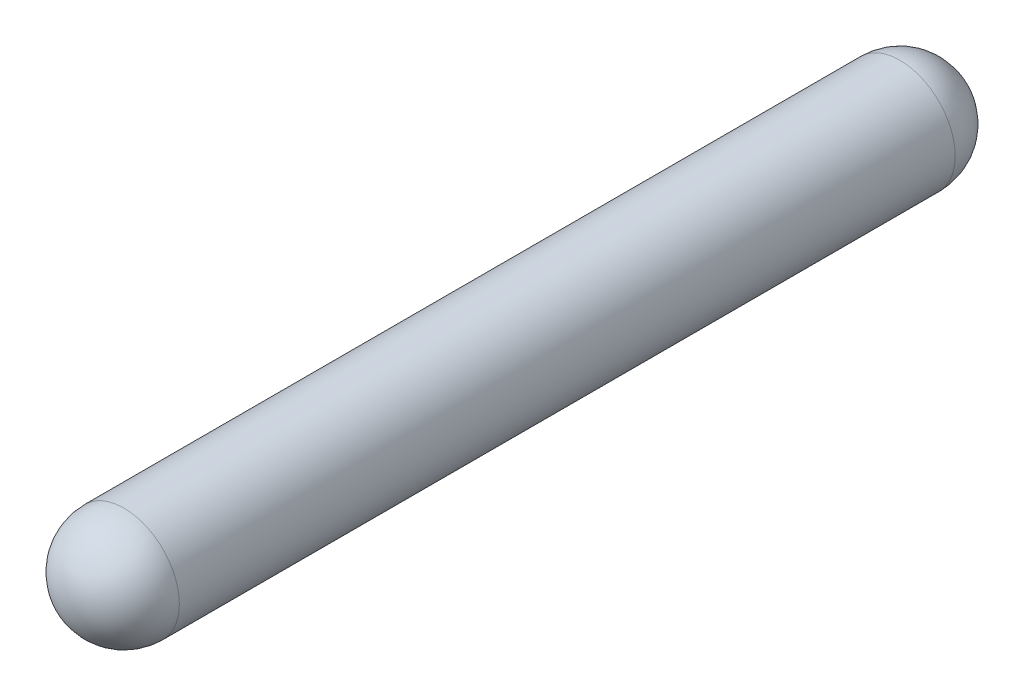
ISO-10303-21;
HEADER;
FILE_DESCRIPTION(('STEP AP214'),'2;1');
FILE_NAME('part.step','',(''),(''),'','','');
FILE_SCHEMA(('AUTOMOTIVE_DESIGN { 1 0 10303 214 1 1 1 1 }'));
ENDSEC;
DATA;
#1=APPLICATION_CONTEXT('core data for automotive mechanical design processes');
#2=APPLICATION_PROTOCOL_DEFINITION('international standard','automotive_design',2000,#1);
#3=PRODUCT_CONTEXT('',#1,'mechanical');
#4=PRODUCT('Part','Part','',(#3));
#5=PRODUCT_RELATED_PRODUCT_CATEGORY('part','',(#4));
#6=PRODUCT_DEFINITION_FORMATION('','',#4);
#7=PRODUCT_DEFINITION_CONTEXT('part definition',#1,'design');
#8=PRODUCT_DEFINITION('design','',#6,#7);
#9=PRODUCT_DEFINITION_SHAPE('','',#8);
#10=(LENGTH_UNIT() NAMED_UNIT(*) SI_UNIT(.MILLI.,.METRE.));
#11=(NAMED_UNIT(*) PLANE_ANGLE_UNIT() SI_UNIT($,.RADIAN.));
#12=(NAMED_UNIT(*) SI_UNIT($,.STERADIAN.) SOLID_ANGLE_UNIT());
#13=UNCERTAINTY_MEASURE_WITH_UNIT(LENGTH_MEASURE(1.E-05),#10,'distance_accuracy_value','');
#14=(GEOMETRIC_REPRESENTATION_CONTEXT(3) GLOBAL_UNCERTAINTY_ASSIGNED_CONTEXT((#13)) GLOBAL_UNIT_ASSIGNED_CONTEXT((#10,
#11,#12)) REPRESENTATION_CONTEXT('',''));
#15=CARTESIAN_POINT('',(0.,0.,0.));
#16=DIRECTION('',(0.,0.,1.));
#17=DIRECTION('',(1.,0.,0.));
#18=AXIS2_PLACEMENT_3D('',#15,#16,#17);
#19=CARTESIAN_POINT('',(0.,0.,70.18));
#20=DIRECTION('',(0.,0.,-1.));
#21=DIRECTION('',(-1.,0.,0.));
#22=AXIS2_PLACEMENT_3D('',#19,#20,#21);
#23=CYLINDRICAL_SURFACE('',#22,5.);
#24=CARTESIAN_POINT('',(0.,0.,70.18));
#25=DIRECTION('',(0.,0.,1.));
#26=DIRECTION('',(1.,0.,0.));
#27=AXIS2_PLACEMENT_3D('',#24,#25,#26);
#28=CIRCLE('',#27,5.);
#29=CARTESIAN_POINT('',(5.,0.,70.18));
#30=VERTEX_POINT('',#29);
#31=EDGE_CURVE('E10',#30,#30,#28,.T.);
#32=ORIENTED_EDGE('',*,*,#31,.F.);
#33=EDGE_LOOP('',(#32));
#34=FACE_BOUND('',#33,.T.);
#35=CARTESIAN_POINT('',(0.,0.,0.));
#36=DIRECTION('',(0.,0.,1.));
#37=DIRECTION('',(1.,0.,0.));
#38=AXIS2_PLACEMENT_3D('',#35,#36,#37);
#39=CIRCLE('',#38,5.);
#40=CARTESIAN_POINT('',(5.,0.,0.));
#41=VERTEX_POINT('',#40);
#42=EDGE_CURVE('E44',#41,#41,#39,.F.);
#43=ORIENTED_EDGE('',*,*,#42,.F.);
#44=EDGE_LOOP('',(#43));
#45=FACE_BOUND('',#44,.T.);
#46=ADVANCED_FACE('F37',(#34,#45),#23,.T.);
#47=CARTESIAN_POINT('',(0.,0.,0.));
#48=DIRECTION('',(0.,1.,0.));
#49=DIRECTION('',(0.,0.,-1.));
#50=AXIS2_PLACEMENT_3D('',#47,#48,#49);
#51=SPHERICAL_SURFACE('',#50,5.);
#52=CARTESIAN_POINT('',(0.,0.,0.));
#53=DIRECTION('',(0.,0.,1.));
#54=DIRECTION('',(1.,0.,0.));
#55=AXIS2_PLACEMENT_3D('',#52,#53,#54);
#56=SPHERICAL_SURFACE('',#55,5.);
#57=ORIENTED_EDGE('',*,*,#42,.T.);
#58=EDGE_LOOP('',(#57));
#59=FACE_BOUND('',#58,.T.);
#60=ADVANCED_FACE('F51',(#59),#56,.T.);
#61=CARTESIAN_POINT('',(0.,0.,70.18));
#62=DIRECTION('',(0.,1.,0.));
#63=DIRECTION('',(0.,0.,-1.));
#64=AXIS2_PLACEMENT_3D('',#61,#62,#63);
#65=SPHERICAL_SURFACE('',#64,5.);
#66=CARTESIAN_POINT('',(0.,0.,70.18));
#67=DIRECTION('',(0.,0.,1.));
#68=DIRECTION('',(1.,0.,0.));
#69=AXIS2_PLACEMENT_3D('',#66,#67,#68);
#70=SPHERICAL_SURFACE('',#69,5.);
#71=ORIENTED_EDGE('',*,*,#31,.T.);
#72=EDGE_LOOP('',(#71));
#73=FACE_BOUND('',#72,.T.);
#74=ADVANCED_FACE('F58',(#73),#70,.T.);
#75=CLOSED_SHELL('',(#46,#60,#74));
#76=MANIFOLD_SOLID_BREP('B2',#75);
#77=ADVANCED_BREP_SHAPE_REPRESENTATION('',(#18,#76),#14);
#78=SHAPE_DEFINITION_REPRESENTATION(#9,#77);
ENDSEC;
END-ISO-10303-21;
